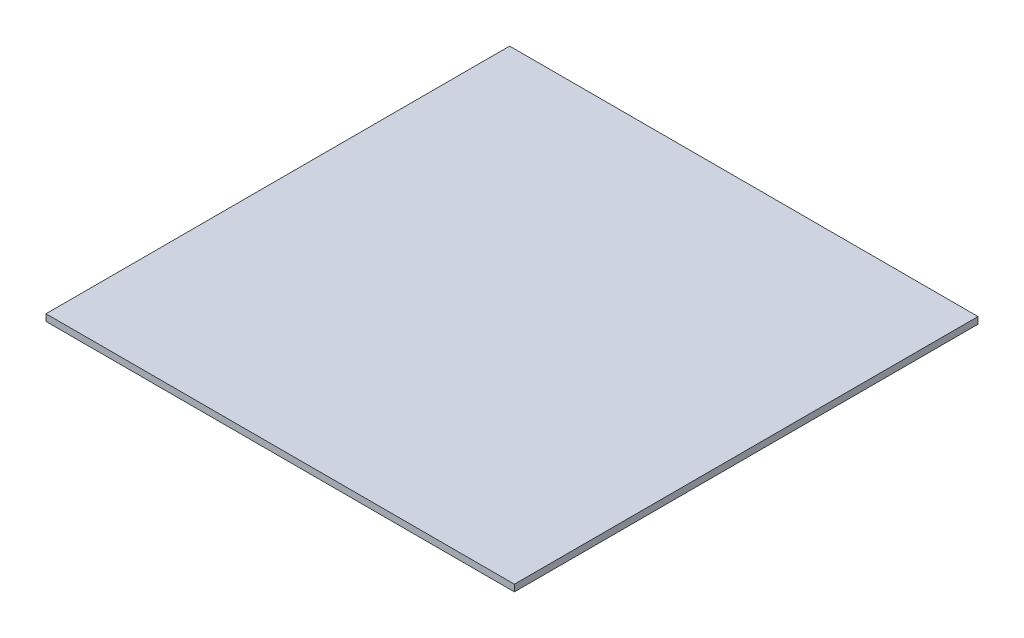
ISO-10303-21;
HEADER;
FILE_DESCRIPTION(('STEP AP214'),'2;1');
FILE_NAME('part.step','',(''),(''),'','','');
FILE_SCHEMA(('AUTOMOTIVE_DESIGN { 1 0 10303 214 1 1 1 1 }'));
ENDSEC;
DATA;
#1=APPLICATION_CONTEXT('core data for automotive mechanical design processes');
#2=APPLICATION_PROTOCOL_DEFINITION('international standard','automotive_design',2000,#1);
#3=PRODUCT_CONTEXT('',#1,'mechanical');
#4=PRODUCT('Part','Part','',(#3));
#5=PRODUCT_RELATED_PRODUCT_CATEGORY('part','',(#4));
#6=PRODUCT_DEFINITION_FORMATION('','',#4);
#7=PRODUCT_DEFINITION_CONTEXT('part definition',#1,'design');
#8=PRODUCT_DEFINITION('design','',#6,#7);
#9=PRODUCT_DEFINITION_SHAPE('','',#8);
#10=(LENGTH_UNIT() NAMED_UNIT(*) SI_UNIT(.MILLI.,.METRE.));
#11=(NAMED_UNIT(*) PLANE_ANGLE_UNIT() SI_UNIT($,.RADIAN.));
#12=(NAMED_UNIT(*) SI_UNIT($,.STERADIAN.) SOLID_ANGLE_UNIT());
#13=UNCERTAINTY_MEASURE_WITH_UNIT(LENGTH_MEASURE(1.E-05),#10,'distance_accuracy_value','');
#14=(GEOMETRIC_REPRESENTATION_CONTEXT(3) GLOBAL_UNCERTAINTY_ASSIGNED_CONTEXT((#13)) GLOBAL_UNIT_ASSIGNED_CONTEXT((#10,
#11,#12)) REPRESENTATION_CONTEXT('',''));
#15=CARTESIAN_POINT('',(0.,0.,0.));
#16=DIRECTION('',(0.,0.,1.));
#17=DIRECTION('',(1.,0.,0.));
#18=AXIS2_PLACEMENT_3D('',#15,#16,#17);
#19=CARTESIAN_POINT('',(0.,10.,346.410161513775));
#20=DIRECTION('',(0.,0.,1.));
#21=DIRECTION('',(1.,0.,0.));
#22=AXIS2_PLACEMENT_3D('',#19,#20,#21);
#23=PLANE('',#22);
#24=DIRECTION('',(-1.,0.,0.));
#25=VECTOR('',#24,1.);
#26=CARTESIAN_POINT('',(0.,0.,346.410161513775));
#27=LINE('',#26,#25);
#28=CARTESIAN_POINT('',(500.,0.,346.410161513775));
#29=VERTEX_POINT('',#28);
#30=CARTESIAN_POINT('',(-200.,0.,346.410161513775));
#31=VERTEX_POINT('',#30);
#32=EDGE_CURVE('E109',#29,#31,#27,.T.);
#33=ORIENTED_EDGE('',*,*,#32,.F.);
#34=DIRECTION('',(0.,-1.,0.));
#35=VECTOR('',#34,1.);
#36=CARTESIAN_POINT('',(500.,10.,346.410161513775));
#37=LINE('',#36,#35);
#38=CARTESIAN_POINT('',(500.,10.,346.410161513775));
#39=VERTEX_POINT('',#38);
#40=EDGE_CURVE('E11',#39,#29,#37,.T.);
#41=ORIENTED_EDGE('',*,*,#40,.F.);
#42=DIRECTION('',(-1.,0.,0.));
#43=VECTOR('',#42,1.);
#44=CARTESIAN_POINT('',(0.,10.,346.410161513775));
#45=LINE('',#44,#43);
#46=CARTESIAN_POINT('',(-200.,10.,346.410161513775));
#47=VERTEX_POINT('',#46);
#48=EDGE_CURVE('E98',#39,#47,#45,.T.);
#49=ORIENTED_EDGE('',*,*,#48,.T.);
#50=DIRECTION('',(0.,-1.,0.));
#51=VECTOR('',#50,1.);
#52=CARTESIAN_POINT('',(-200.,10.,346.410161513775));
#53=LINE('',#52,#51);
#54=EDGE_CURVE('E58',#47,#31,#53,.T.);
#55=ORIENTED_EDGE('',*,*,#54,.T.);
#56=EDGE_LOOP('',(#33,#41,#49,#55));
#57=FACE_BOUND('',#56,.T.);
#58=ADVANCED_FACE('F41',(#57),#23,.T.);
#59=CARTESIAN_POINT('',(500.,10.,0.));
#60=DIRECTION('',(1.,0.,0.));
#61=DIRECTION('',(0.,0.,-1.));
#62=AXIS2_PLACEMENT_3D('',#59,#60,#61);
#63=PLANE('',#62);
#64=DIRECTION('',(0.,0.,1.));
#65=VECTOR('',#64,1.);
#66=CARTESIAN_POINT('',(500.,0.,0.));
#67=LINE('',#66,#65);
#68=CARTESIAN_POINT('',(500.,0.,-346.410161513775));
#69=VERTEX_POINT('',#68);
#70=EDGE_CURVE('E88',#69,#29,#67,.T.);
#71=ORIENTED_EDGE('',*,*,#70,.F.);
#72=DIRECTION('',(0.,-1.,0.));
#73=VECTOR('',#72,1.);
#74=CARTESIAN_POINT('',(500.,10.,-346.410161513775));
#75=LINE('',#74,#73);
#76=CARTESIAN_POINT('',(500.,10.,-346.410161513775));
#77=VERTEX_POINT('',#76);
#78=EDGE_CURVE('E50',#77,#69,#75,.T.);
#79=ORIENTED_EDGE('',*,*,#78,.F.);
#80=DIRECTION('',(0.,0.,1.));
#81=VECTOR('',#80,1.);
#82=CARTESIAN_POINT('',(500.,10.,0.));
#83=LINE('',#82,#81);
#84=EDGE_CURVE('E86',#77,#39,#83,.T.);
#85=ORIENTED_EDGE('',*,*,#84,.T.);
#86=ORIENTED_EDGE('',*,*,#40,.T.);
#87=EDGE_LOOP('',(#71,#79,#85,#86));
#88=FACE_BOUND('',#87,.T.);
#89=ADVANCED_FACE('F85',(#88),#63,.T.);
#90=CARTESIAN_POINT('',(0.,10.,-346.410161513775));
#91=DIRECTION('',(0.,0.,-1.));
#92=DIRECTION('',(-1.,0.,0.));
#93=AXIS2_PLACEMENT_3D('',#90,#91,#92);
#94=PLANE('',#93);
#95=DIRECTION('',(1.,0.,0.));
#96=VECTOR('',#95,1.);
#97=CARTESIAN_POINT('',(0.,0.,-346.410161513775));
#98=LINE('',#97,#96);
#99=CARTESIAN_POINT('',(-200.,0.,-346.410161513775));
#100=VERTEX_POINT('',#99);
#101=EDGE_CURVE('E114',#100,#69,#98,.T.);
#102=ORIENTED_EDGE('',*,*,#101,.F.);
#103=DIRECTION('',(0.,-1.,0.));
#104=VECTOR('',#103,1.);
#105=CARTESIAN_POINT('',(-200.,10.,-346.410161513775));
#106=LINE('',#105,#104);
#107=CARTESIAN_POINT('',(-200.,10.,-346.410161513775));
#108=VERTEX_POINT('',#107);
#109=EDGE_CURVE('E71',#108,#100,#106,.T.);
#110=ORIENTED_EDGE('',*,*,#109,.F.);
#111=DIRECTION('',(1.,0.,0.));
#112=VECTOR('',#111,1.);
#113=CARTESIAN_POINT('',(0.,10.,-346.410161513775));
#114=LINE('',#113,#112);
#115=EDGE_CURVE('E97',#108,#77,#114,.T.);
#116=ORIENTED_EDGE('',*,*,#115,.T.);
#117=ORIENTED_EDGE('',*,*,#78,.T.);
#118=EDGE_LOOP('',(#102,#110,#116,#117));
#119=FACE_BOUND('',#118,.T.);
#120=ADVANCED_FACE('F101',(#119),#94,.T.);
#121=CARTESIAN_POINT('',(-200.,10.,0.));
#122=DIRECTION('',(-1.,0.,0.));
#123=DIRECTION('',(0.,0.,1.));
#124=AXIS2_PLACEMENT_3D('',#121,#122,#123);
#125=PLANE('',#124);
#126=DIRECTION('',(0.,0.,-1.));
#127=VECTOR('',#126,1.);
#128=CARTESIAN_POINT('',(-200.,0.,0.));
#129=LINE('',#128,#127);
#130=EDGE_CURVE('E117',#31,#100,#129,.T.);
#131=ORIENTED_EDGE('',*,*,#130,.F.);
#132=ORIENTED_EDGE('',*,*,#54,.F.);
#133=DIRECTION('',(0.,0.,-1.));
#134=VECTOR('',#133,1.);
#135=CARTESIAN_POINT('',(-200.,10.,0.));
#136=LINE('',#135,#134);
#137=EDGE_CURVE('E103',#47,#108,#136,.T.);
#138=ORIENTED_EDGE('',*,*,#137,.T.);
#139=ORIENTED_EDGE('',*,*,#109,.T.);
#140=EDGE_LOOP('',(#131,#132,#138,#139));
#141=FACE_BOUND('',#140,.T.);
#142=ADVANCED_FACE('F126',(#141),#125,.T.);
#143=CARTESIAN_POINT('',(0.,10.,0.));
#144=DIRECTION('',(0.,1.,0.));
#145=DIRECTION('',(0.,0.,1.));
#146=AXIS2_PLACEMENT_3D('',#143,#144,#145);
#147=PLANE('',#146);
#148=ORIENTED_EDGE('',*,*,#48,.F.);
#149=ORIENTED_EDGE('',*,*,#84,.F.);
#150=ORIENTED_EDGE('',*,*,#115,.F.);
#151=ORIENTED_EDGE('',*,*,#137,.F.);
#152=EDGE_LOOP('',(#148,#149,#150,#151));
#153=FACE_BOUND('',#152,.T.);
#154=ADVANCED_FACE('F95',(#153),#147,.T.);
#155=CARTESIAN_POINT('',(0.,0.,0.));
#156=DIRECTION('',(0.,1.,0.));
#157=DIRECTION('',(0.,0.,1.));
#158=AXIS2_PLACEMENT_3D('',#155,#156,#157);
#159=PLANE('',#158);
#160=ORIENTED_EDGE('',*,*,#32,.T.);
#161=ORIENTED_EDGE('',*,*,#130,.T.);
#162=ORIENTED_EDGE('',*,*,#101,.T.);
#163=ORIENTED_EDGE('',*,*,#70,.T.);
#164=EDGE_LOOP('',(#160,#161,#162,#163));
#165=FACE_BOUND('',#164,.T.);
#166=ADVANCED_FACE('F133',(#165),#159,.F.);
#167=CLOSED_SHELL('',(#58,#89,#120,#142,#154,#166));
#168=MANIFOLD_SOLID_BREP('B2',#167);
#169=ADVANCED_BREP_SHAPE_REPRESENTATION('',(#18,#168),#14);
#170=SHAPE_DEFINITION_REPRESENTATION(#9,#169);
ENDSEC;
END-ISO-10303-21;
